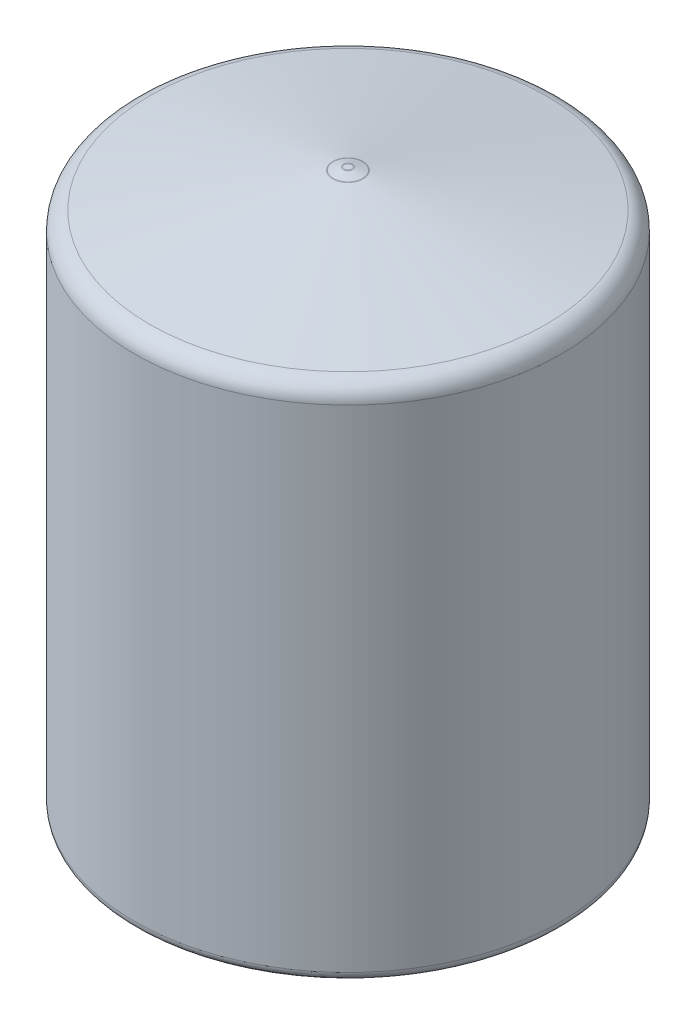
ISO-10303-21;
HEADER;
FILE_DESCRIPTION(('STEP AP214'),'2;1');
FILE_NAME('part.step','',(''),(''),'','','');
FILE_SCHEMA(('AUTOMOTIVE_DESIGN { 1 0 10303 214 1 1 1 1 }'));
ENDSEC;
DATA;
#1=APPLICATION_CONTEXT('core data for automotive mechanical design processes');
#2=APPLICATION_PROTOCOL_DEFINITION('international standard','automotive_design',2000,#1);
#3=PRODUCT_CONTEXT('',#1,'mechanical');
#4=PRODUCT('Part','Part','',(#3));
#5=PRODUCT_RELATED_PRODUCT_CATEGORY('part','',(#4));
#6=PRODUCT_DEFINITION_FORMATION('','',#4);
#7=PRODUCT_DEFINITION_CONTEXT('part definition',#1,'design');
#8=PRODUCT_DEFINITION('design','',#6,#7);
#9=PRODUCT_DEFINITION_SHAPE('','',#8);
#10=(LENGTH_UNIT() NAMED_UNIT(*) SI_UNIT(.MILLI.,.METRE.));
#11=(NAMED_UNIT(*) PLANE_ANGLE_UNIT() SI_UNIT($,.RADIAN.));
#12=(NAMED_UNIT(*) SI_UNIT($,.STERADIAN.) SOLID_ANGLE_UNIT());
#13=UNCERTAINTY_MEASURE_WITH_UNIT(LENGTH_MEASURE(1.E-05),#10,'distance_accuracy_value','');
#14=(GEOMETRIC_REPRESENTATION_CONTEXT(3) GLOBAL_UNCERTAINTY_ASSIGNED_CONTEXT((#13)) GLOBAL_UNIT_ASSIGNED_CONTEXT((#10,
#11,#12)) REPRESENTATION_CONTEXT('',''));
#15=CARTESIAN_POINT('',(0.,0.,0.));
#16=DIRECTION('',(0.,0.,1.));
#17=DIRECTION('',(1.,0.,0.));
#18=AXIS2_PLACEMENT_3D('',#15,#16,#17);
#19=CARTESIAN_POINT('',(10.,0.,0.));
#20=DIRECTION('',(0.,-1.,0.));
#21=DIRECTION('',(0.,0.,-1.));
#22=AXIS2_PLACEMENT_3D('',#19,#20,#21);
#23=PLANE('',#22);
#24=CARTESIAN_POINT('',(0.,0.,0.));
#25=DIRECTION('',(0.,-1.,0.));
#26=DIRECTION('',(0.,0.,-1.));
#27=AXIS2_PLACEMENT_3D('',#24,#25,#26);
#28=CIRCLE('',#27,10.5);
#29=CARTESIAN_POINT('',(0.,0.,-10.5));
#30=VERTEX_POINT('',#29);
#31=EDGE_CURVE('E111',#30,#30,#28,.F.);
#32=ORIENTED_EDGE('',*,*,#31,.T.);
#33=EDGE_LOOP('',(#32));
#34=FACE_BOUND('',#33,.T.);
#35=CARTESIAN_POINT('',(0.,0.,0.));
#36=DIRECTION('',(0.,-1.,0.));
#37=DIRECTION('',(0.,0.,-1.));
#38=AXIS2_PLACEMENT_3D('',#35,#36,#37);
#39=CIRCLE('',#38,11.);
#40=CARTESIAN_POINT('',(0.,0.,-11.));
#41=VERTEX_POINT('',#40);
#42=EDGE_CURVE('E110',#41,#41,#39,.T.);
#43=ORIENTED_EDGE('',*,*,#42,.T.);
#44=EDGE_LOOP('',(#43));
#45=FACE_BOUND('',#44,.T.);
#46=ADVANCED_FACE('F53',(#34,#45),#23,.T.);
#47=CARTESIAN_POINT('',(0.,9.5,0.));
#48=DIRECTION('',(0.,-1.,0.));
#49=DIRECTION('',(0.,0.,-1.));
#50=AXIS2_PLACEMENT_3D('',#47,#48,#49);
#51=CYLINDRICAL_SURFACE('',#50,11.5);
#52=CARTESIAN_POINT('',(0.,0.5,0.));
#53=DIRECTION('',(0.,-1.,0.));
#54=DIRECTION('',(0.,0.,-1.));
#55=AXIS2_PLACEMENT_3D('',#52,#53,#54);
#56=CIRCLE('',#55,11.5);
#57=CARTESIAN_POINT('',(0.,0.5,-11.5));
#58=VERTEX_POINT('',#57);
#59=EDGE_CURVE('E107',#58,#58,#56,.F.);
#60=ORIENTED_EDGE('',*,*,#59,.T.);
#61=EDGE_LOOP('',(#60));
#62=FACE_BOUND('',#61,.T.);
#63=CARTESIAN_POINT('',(0.,27.,0.));
#64=DIRECTION('',(0.,-1.,0.));
#65=DIRECTION('',(0.,0.,-1.));
#66=AXIS2_PLACEMENT_3D('',#63,#64,#65);
#67=CIRCLE('',#66,11.5);
#68=CARTESIAN_POINT('',(0.,27.,-11.5));
#69=VERTEX_POINT('',#68);
#70=EDGE_CURVE('E116',#69,#69,#67,.T.);
#71=ORIENTED_EDGE('',*,*,#70,.T.);
#72=EDGE_LOOP('',(#71));
#73=FACE_BOUND('',#72,.T.);
#74=ADVANCED_FACE('F81',(#62,#73),#51,.T.);
#75=CARTESIAN_POINT('',(0.,27.,0.));
#76=DIRECTION('',(0.,-1.,0.));
#77=DIRECTION('',(0.,0.,-1.));
#78=AXIS2_PLACEMENT_3D('',#75,#76,#77);
#79=TOROIDAL_SURFACE('',#78,10.5,0.999999999999999);
#80=CARTESIAN_POINT('',(0.,27.9826411458901,0.));
#81=DIRECTION('',(0.,-1.,0.));
#82=DIRECTION('',(0.,0.,-1.));
#83=AXIS2_PLACEMENT_3D('',#80,#81,#82);
#84=CIRCLE('',#83,10.6855165178734);
#85=CARTESIAN_POINT('',(0.,27.9826411458901,-10.6855165178734));
#86=VERTEX_POINT('',#85);
#87=EDGE_CURVE('E131',#86,#86,#84,.T.);
#88=ORIENTED_EDGE('',*,*,#87,.T.);
#89=EDGE_LOOP('',(#88));
#90=FACE_BOUND('',#89,.T.);
#91=ORIENTED_EDGE('',*,*,#70,.F.);
#92=EDGE_LOOP('',(#91));
#93=FACE_BOUND('',#92,.T.);
#94=ADVANCED_FACE('F87',(#90,#93),#79,.T.);
#95=CARTESIAN_POINT('',(0.,27.9826411458901,0.));
#96=DIRECTION('',(0.,-1.,0.));
#97=DIRECTION('',(0.,0.,-1.));
#98=AXIS2_PLACEMENT_3D('',#95,#96,#97);
#99=CONICAL_SURFACE('',#98,10.6855165178734,1.38419884809554);
#100=CARTESIAN_POINT('',(0.,29.8456873908335,0.));
#101=DIRECTION('',(0.,-1.,0.));
#102=DIRECTION('',(0.,0.,-1.));
#103=AXIS2_PLACEMENT_3D('',#100,#101,#102);
#104=CIRCLE('',#103,0.817360744126329);
#105=CARTESIAN_POINT('',(0.,29.8456873908335,-0.817360744126329));
#106=VERTEX_POINT('',#105);
#107=EDGE_CURVE('E60',#106,#106,#104,.T.);
#108=ORIENTED_EDGE('',*,*,#107,.T.);
#109=EDGE_LOOP('',(#108));
#110=FACE_BOUND('',#109,.T.);
#111=ORIENTED_EDGE('',*,*,#87,.F.);
#112=EDGE_LOOP('',(#111));
#113=FACE_BOUND('',#112,.T.);
#114=ADVANCED_FACE('F123',(#110,#113),#99,.T.);
#115=CARTESIAN_POINT('',(0.,29.8489649910149,0.));
#116=DIRECTION('',(0.,-1.,0.));
#117=DIRECTION('',(0.,0.,-1.));
#118=AXIS2_PLACEMENT_3D('',#115,#116,#117);
#119=CONICAL_SURFACE('',#118,0.8,1.3135585158011);
#120=CARTESIAN_POINT('',(0.,29.853459765938,0.));
#121=DIRECTION('',(0.,-1.,0.));
#122=DIRECTION('',(0.,0.,-1.));
#123=AXIS2_PLACEMENT_3D('',#120,#121,#122);
#124=CIRCLE('',#123,0.782913891667183);
#125=CARTESIAN_POINT('',(0.,29.853459765938,-0.782913891667183));
#126=VERTEX_POINT('',#125);
#127=EDGE_CURVE('E13',#126,#126,#124,.F.);
#128=ORIENTED_EDGE('',*,*,#127,.T.);
#129=EDGE_LOOP('',(#128));
#130=FACE_BOUND('',#129,.T.);
#131=CARTESIAN_POINT('',(0.,29.9934192791362,0.));
#132=DIRECTION('',(0.,-1.,0.));
#133=DIRECTION('',(0.,0.,-1.));
#134=AXIS2_PLACEMENT_3D('',#131,#132,#133);
#135=CIRCLE('',#134,0.250882044558329);
#136=CARTESIAN_POINT('',(0.,29.9934192791362,-0.250882044558329));
#137=VERTEX_POINT('',#136);
#138=EDGE_CURVE('E133',#137,#137,#135,.T.);
#139=ORIENTED_EDGE('',*,*,#138,.T.);
#140=EDGE_LOOP('',(#139));
#141=FACE_BOUND('',#140,.T.);
#142=ADVANCED_FACE('F127',(#130,#141),#119,.T.);
#143=CARTESIAN_POINT('',(0.,29.8,0.));
#144=DIRECTION('',(0.,-1.,0.));
#145=DIRECTION('',(0.,0.,-1.));
#146=AXIS2_PLACEMENT_3D('',#143,#144,#145);
#147=DEGENERATE_TOROIDAL_SURFACE('',#146,0.2,0.200000000000002,.T.);
#148=CARTESIAN_POINT('',(0.,30.,0.));
#149=DIRECTION('',(0.,-1.,0.));
#150=DIRECTION('',(0.,0.,-1.));
#151=AXIS2_PLACEMENT_3D('',#148,#149,#150);
#152=CIRCLE('',#151,0.2);
#153=CARTESIAN_POINT('',(0.,30.,-0.2));
#154=VERTEX_POINT('',#153);
#155=EDGE_CURVE('E137',#154,#154,#152,.T.);
#156=ORIENTED_EDGE('',*,*,#155,.T.);
#157=EDGE_LOOP('',(#156));
#158=FACE_BOUND('',#157,.T.);
#159=ORIENTED_EDGE('',*,*,#138,.F.);
#160=EDGE_LOOP('',(#159));
#161=FACE_BOUND('',#160,.T.);
#162=ADVANCED_FACE('F76',(#158,#161),#147,.T.);
#163=CARTESIAN_POINT('',(0.2,30.,0.));
#164=DIRECTION('',(0.,1.,0.));
#165=DIRECTION('',(0.,0.,1.));
#166=AXIS2_PLACEMENT_3D('',#163,#164,#165);
#167=PLANE('',#166);
#168=ORIENTED_EDGE('',*,*,#155,.F.);
#169=EDGE_LOOP('',(#168));
#170=FACE_BOUND('',#169,.T.);
#171=ADVANCED_FACE('F66',(#170),#167,.T.);
#172=CARTESIAN_POINT('',(0.,29.5,0.));
#173=DIRECTION('',(0.,-1.,0.));
#174=DIRECTION('',(0.,0.,-1.));
#175=AXIS2_PLACEMENT_3D('',#172,#173,#174);
#176=CONICAL_SURFACE('',#175,0.,0.785398163397451);
#177=CARTESIAN_POINT('',(0.,28.234602605913,0.));
#178=DIRECTION('',(0.,-1.,0.));
#179=DIRECTION('',(0.,0.,-1.));
#180=AXIS2_PLACEMENT_3D('',#177,#178,#179);
#181=CIRCLE('',#180,1.26539739408706);
#182=CARTESIAN_POINT('',(0.,28.234602605913,-1.26539739408706));
#183=VERTEX_POINT('',#182);
#184=EDGE_CURVE('E142',#183,#183,#181,.T.);
#185=ORIENTED_EDGE('',*,*,#184,.T.);
#186=EDGE_LOOP('',(#185));
#187=FACE_BOUND('',#186,.T.);
#188=CARTESIAN_POINT('',(0.,29.5,0.));
#189=VERTEX_POINT('',#188);
#190=VERTEX_LOOP('',#189);
#191=FACE_BOUND('',#190,.T.);
#192=ADVANCED_FACE('F63',(#187,#191),#176,.F.);
#193=CARTESIAN_POINT('',(0.,28.234602605913,0.));
#194=DIRECTION('',(0.,-1.,0.));
#195=DIRECTION('',(0.,0.,-1.));
#196=AXIS2_PLACEMENT_3D('',#193,#194,#195);
#197=CONICAL_SURFACE('',#196,1.26539739408706,1.38419884809554);
#198=CARTESIAN_POINT('',(0.,26.5855641270807,0.));
#199=DIRECTION('',(0.,-1.,0.));
#200=DIRECTION('',(0.,0.,-1.));
#201=AXIS2_PLACEMENT_3D('',#198,#199,#200);
#202=CIRCLE('',#201,10.);
#203=CARTESIAN_POINT('',(0.,26.5855641270807,-10.));
#204=VERTEX_POINT('',#203);
#205=EDGE_CURVE('E144',#204,#204,#202,.T.);
#206=ORIENTED_EDGE('',*,*,#205,.T.);
#207=EDGE_LOOP('',(#206));
#208=FACE_BOUND('',#207,.T.);
#209=ORIENTED_EDGE('',*,*,#184,.F.);
#210=EDGE_LOOP('',(#209));
#211=FACE_BOUND('',#210,.T.);
#212=ADVANCED_FACE('F65',(#208,#211),#197,.F.);
#213=CARTESIAN_POINT('',(0.,9.5,0.));
#214=DIRECTION('',(0.,-1.,0.));
#215=DIRECTION('',(0.,0.,-1.));
#216=AXIS2_PLACEMENT_3D('',#213,#214,#215);
#217=CYLINDRICAL_SURFACE('',#216,10.);
#218=CARTESIAN_POINT('',(0.,0.5,0.));
#219=DIRECTION('',(0.,-1.,0.));
#220=DIRECTION('',(0.,0.,-1.));
#221=AXIS2_PLACEMENT_3D('',#218,#219,#220);
#222=CIRCLE('',#221,10.);
#223=CARTESIAN_POINT('',(0.,0.5,-10.));
#224=VERTEX_POINT('',#223);
#225=EDGE_CURVE('E112',#224,#224,#222,.T.);
#226=ORIENTED_EDGE('',*,*,#225,.T.);
#227=EDGE_LOOP('',(#226));
#228=FACE_BOUND('',#227,.T.);
#229=ORIENTED_EDGE('',*,*,#205,.F.);
#230=EDGE_LOOP('',(#229));
#231=FACE_BOUND('',#230,.T.);
#232=ADVANCED_FACE('F73',(#228,#231),#217,.F.);
#233=CARTESIAN_POINT('',(0.,0.5,0.));
#234=DIRECTION('',(0.,-1.,0.));
#235=DIRECTION('',(0.,0.,-1.));
#236=AXIS2_PLACEMENT_3D('',#233,#234,#235);
#237=TOROIDAL_SURFACE('',#236,10.5,0.5);
#238=ORIENTED_EDGE('',*,*,#31,.F.);
#239=EDGE_LOOP('',(#238));
#240=FACE_BOUND('',#239,.T.);
#241=ORIENTED_EDGE('',*,*,#225,.F.);
#242=EDGE_LOOP('',(#241));
#243=FACE_BOUND('',#242,.T.);
#244=ADVANCED_FACE('F94',(#240,#243),#237,.T.);
#245=CARTESIAN_POINT('',(0.,0.5,0.));
#246=DIRECTION('',(0.,-1.,0.));
#247=DIRECTION('',(0.,0.,-1.));
#248=AXIS2_PLACEMENT_3D('',#245,#246,#247);
#249=TOROIDAL_SURFACE('',#248,11.,0.5);
#250=ORIENTED_EDGE('',*,*,#59,.F.);
#251=EDGE_LOOP('',(#250));
#252=FACE_BOUND('',#251,.T.);
#253=ORIENTED_EDGE('',*,*,#42,.F.);
#254=EDGE_LOOP('',(#253));
#255=FACE_BOUND('',#254,.T.);
#256=ADVANCED_FACE('F96',(#252,#255),#249,.T.);
#257=CARTESIAN_POINT('',(0.,30.3370079637785,0.));
#258=DIRECTION('',(0.,-1.,0.));
#259=DIRECTION('',(0.,0.,-1.));
#260=AXIS2_PLACEMENT_3D('',#257,#258,#259);
#261=TOROIDAL_SURFACE('',#260,0.910119003063006,0.5);
#262=ORIENTED_EDGE('',*,*,#127,.F.);
#263=EDGE_LOOP('',(#262));
#264=FACE_BOUND('',#263,.T.);
#265=ORIENTED_EDGE('',*,*,#107,.F.);
#266=EDGE_LOOP('',(#265));
#267=FACE_BOUND('',#266,.T.);
#268=ADVANCED_FACE('F55',(#264,#267),#261,.F.);
#269=CLOSED_SHELL('',(#46,#74,#94,#114,#142,#162,#171,#192,#212,#232,#244,#256,#268));
#270=MANIFOLD_SOLID_BREP('B2',#269);
#271=ADVANCED_BREP_SHAPE_REPRESENTATION('',(#18,#270),#14);
#272=SHAPE_DEFINITION_REPRESENTATION(#9,#271);
ENDSEC;
END-ISO-10303-21;
